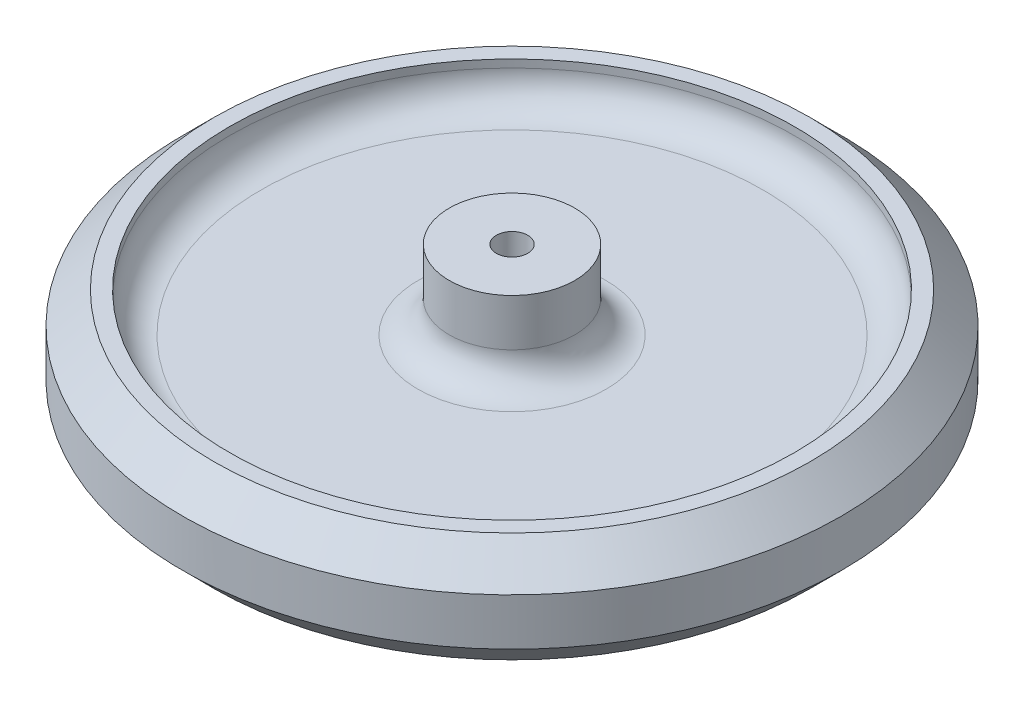
ISO-10303-21;
HEADER;
FILE_DESCRIPTION(('STEP AP214'),'2;1');
FILE_NAME('part.step','',(''),(''),'','','');
FILE_SCHEMA(('AUTOMOTIVE_DESIGN { 1 0 10303 214 1 1 1 1 }'));
ENDSEC;
DATA;
#1=APPLICATION_CONTEXT('core data for automotive mechanical design processes');
#2=APPLICATION_PROTOCOL_DEFINITION('international standard','automotive_design',2000,#1);
#3=PRODUCT_CONTEXT('',#1,'mechanical');
#4=PRODUCT('Part','Part','',(#3));
#5=PRODUCT_RELATED_PRODUCT_CATEGORY('part','',(#4));
#6=PRODUCT_DEFINITION_FORMATION('','',#4);
#7=PRODUCT_DEFINITION_CONTEXT('part definition',#1,'design');
#8=PRODUCT_DEFINITION('design','',#6,#7);
#9=PRODUCT_DEFINITION_SHAPE('','',#8);
#10=(LENGTH_UNIT() NAMED_UNIT(*) SI_UNIT(.MILLI.,.METRE.));
#11=(NAMED_UNIT(*) PLANE_ANGLE_UNIT() SI_UNIT($,.RADIAN.));
#12=(NAMED_UNIT(*) SI_UNIT($,.STERADIAN.) SOLID_ANGLE_UNIT());
#13=UNCERTAINTY_MEASURE_WITH_UNIT(LENGTH_MEASURE(1.E-05),#10,'distance_accuracy_value','');
#14=(GEOMETRIC_REPRESENTATION_CONTEXT(3) GLOBAL_UNCERTAINTY_ASSIGNED_CONTEXT((#13)) GLOBAL_UNIT_ASSIGNED_CONTEXT((#10,
#11,#12)) REPRESENTATION_CONTEXT('',''));
#15=CARTESIAN_POINT('',(0.,0.,0.));
#16=DIRECTION('',(0.,0.,1.));
#17=DIRECTION('',(1.,0.,0.));
#18=AXIS2_PLACEMENT_3D('',#15,#16,#17);
#19=CARTESIAN_POINT('',(-6.35,1.5875,0.));
#20=DIRECTION('',(0.,-1.,0.));
#21=DIRECTION('',(1.,0.,0.));
#22=AXIS2_PLACEMENT_3D('',#19,#20,#21);
#23=PLANE('',#22);
#24=CARTESIAN_POINT('',(0.,1.5875,0.));
#25=DIRECTION('',(0.,-1.,0.));
#26=DIRECTION('',(1.,0.,0.));
#27=AXIS2_PLACEMENT_3D('',#24,#25,#26);
#28=CIRCLE('',#27,9.525);
#29=CARTESIAN_POINT('',(9.525,1.5875,0.));
#30=VERTEX_POINT('',#29);
#31=EDGE_CURVE('E57',#30,#30,#28,.T.);
#32=ORIENTED_EDGE('',*,*,#31,.T.);
#33=EDGE_LOOP('',(#32));
#34=FACE_BOUND('',#33,.T.);
#35=CARTESIAN_POINT('',(0.,1.5875,0.));
#36=DIRECTION('',(0.,-1.,0.));
#37=DIRECTION('',(1.,0.,0.));
#38=AXIS2_PLACEMENT_3D('',#35,#36,#37);
#39=CIRCLE('',#38,25.4);
#40=CARTESIAN_POINT('',(25.4,1.58750000000001,0.));
#41=VERTEX_POINT('',#40);
#42=EDGE_CURVE('E60',#41,#41,#39,.F.);
#43=ORIENTED_EDGE('',*,*,#42,.T.);
#44=EDGE_LOOP('',(#43));
#45=FACE_BOUND('',#44,.T.);
#46=ADVANCED_FACE('F31',(#34,#45),#23,.F.);
#47=CARTESIAN_POINT('',(0.,-9.525,0.));
#48=DIRECTION('',(0.,-1.,0.));
#49=DIRECTION('',(1.,0.,0.));
#50=AXIS2_PLACEMENT_3D('',#47,#48,#49);
#51=CYLINDRICAL_SURFACE('',#50,6.35);
#52=CARTESIAN_POINT('',(0.,4.7625,0.));
#53=DIRECTION('',(0.,-1.,0.));
#54=DIRECTION('',(1.,0.,0.));
#55=AXIS2_PLACEMENT_3D('',#52,#53,#54);
#56=CIRCLE('',#55,6.35);
#57=CARTESIAN_POINT('',(6.35,4.7625,0.));
#58=VERTEX_POINT('',#57);
#59=EDGE_CURVE('E54',#58,#58,#56,.F.);
#60=ORIENTED_EDGE('',*,*,#59,.T.);
#61=EDGE_LOOP('',(#60));
#62=FACE_BOUND('',#61,.T.);
#63=CARTESIAN_POINT('',(0.,9.525,0.));
#64=DIRECTION('',(0.,-1.,0.));
#65=DIRECTION('',(1.,0.,0.));
#66=AXIS2_PLACEMENT_3D('',#63,#64,#65);
#67=CIRCLE('',#66,6.35);
#68=CARTESIAN_POINT('',(6.35,9.525,0.));
#69=VERTEX_POINT('',#68);
#70=EDGE_CURVE('E75',#69,#69,#67,.T.);
#71=ORIENTED_EDGE('',*,*,#70,.T.);
#72=EDGE_LOOP('',(#71));
#73=FACE_BOUND('',#72,.T.);
#74=ADVANCED_FACE('F111',(#62,#73),#51,.T.);
#75=CARTESIAN_POINT('',(-6.35,9.525,0.));
#76=DIRECTION('',(0.,-1.,0.));
#77=DIRECTION('',(1.,0.,0.));
#78=AXIS2_PLACEMENT_3D('',#75,#76,#77);
#79=PLANE('',#78);
#80=ORIENTED_EDGE('',*,*,#70,.F.);
#81=EDGE_LOOP('',(#80));
#82=FACE_BOUND('',#81,.T.);
#83=CARTESIAN_POINT('',(0.,9.525,0.));
#84=DIRECTION('',(0.,-1.,0.));
#85=DIRECTION('',(1.,0.,0.));
#86=AXIS2_PLACEMENT_3D('',#83,#84,#85);
#87=CIRCLE('',#86,1.5875);
#88=CARTESIAN_POINT('',(1.5875,9.525,0.));
#89=VERTEX_POINT('',#88);
#90=EDGE_CURVE('E78',#89,#89,#87,.T.);
#91=ORIENTED_EDGE('',*,*,#90,.T.);
#92=EDGE_LOOP('',(#91));
#93=FACE_BOUND('',#92,.T.);
#94=ADVANCED_FACE('F117',(#82,#93),#79,.F.);
#95=CARTESIAN_POINT('',(0.,-9.525,0.));
#96=DIRECTION('',(0.,-1.,0.));
#97=DIRECTION('',(1.,0.,0.));
#98=AXIS2_PLACEMENT_3D('',#95,#96,#97);
#99=CYLINDRICAL_SURFACE('',#98,1.5875);
#100=ORIENTED_EDGE('',*,*,#90,.F.);
#101=EDGE_LOOP('',(#100));
#102=FACE_BOUND('',#101,.T.);
#103=CARTESIAN_POINT('',(0.,-9.525,0.));
#104=DIRECTION('',(0.,-1.,0.));
#105=DIRECTION('',(1.,0.,0.));
#106=AXIS2_PLACEMENT_3D('',#103,#104,#105);
#107=CIRCLE('',#106,1.5875);
#108=CARTESIAN_POINT('',(1.5875,-9.525,0.));
#109=VERTEX_POINT('',#108);
#110=EDGE_CURVE('E81',#109,#109,#107,.T.);
#111=ORIENTED_EDGE('',*,*,#110,.T.);
#112=EDGE_LOOP('',(#111));
#113=FACE_BOUND('',#112,.T.);
#114=ADVANCED_FACE('F169',(#102,#113),#99,.F.);
#115=CARTESIAN_POINT('',(-1.5875,-9.525,0.));
#116=DIRECTION('',(0.,1.,0.));
#117=DIRECTION('',(-1.,0.,0.));
#118=AXIS2_PLACEMENT_3D('',#115,#116,#117);
#119=PLANE('',#118);
#120=ORIENTED_EDGE('',*,*,#110,.F.);
#121=EDGE_LOOP('',(#120));
#122=FACE_BOUND('',#121,.T.);
#123=CARTESIAN_POINT('',(0.,-9.525,0.));
#124=DIRECTION('',(0.,-1.,0.));
#125=DIRECTION('',(1.,0.,0.));
#126=AXIS2_PLACEMENT_3D('',#123,#124,#125);
#127=CIRCLE('',#126,6.35);
#128=CARTESIAN_POINT('',(6.35,-9.525,0.));
#129=VERTEX_POINT('',#128);
#130=EDGE_CURVE('E84',#129,#129,#127,.T.);
#131=ORIENTED_EDGE('',*,*,#130,.T.);
#132=EDGE_LOOP('',(#131));
#133=FACE_BOUND('',#132,.T.);
#134=ADVANCED_FACE('F165',(#122,#133),#119,.F.);
#135=CARTESIAN_POINT('',(0.,-9.525,0.));
#136=DIRECTION('',(0.,-1.,0.));
#137=DIRECTION('',(1.,0.,0.));
#138=AXIS2_PLACEMENT_3D('',#135,#136,#137);
#139=CYLINDRICAL_SURFACE('',#138,6.35);
#140=CARTESIAN_POINT('',(0.,-4.7625,0.));
#141=DIRECTION('',(0.,1.,0.));
#142=DIRECTION('',(-1.,0.,0.));
#143=AXIS2_PLACEMENT_3D('',#140,#141,#142);
#144=CIRCLE('',#143,6.35);
#145=CARTESIAN_POINT('',(-6.35,-4.7625,0.));
#146=VERTEX_POINT('',#145);
#147=EDGE_CURVE('E63',#146,#146,#144,.F.);
#148=ORIENTED_EDGE('',*,*,#147,.T.);
#149=EDGE_LOOP('',(#148));
#150=FACE_BOUND('',#149,.T.);
#151=ORIENTED_EDGE('',*,*,#130,.F.);
#152=EDGE_LOOP('',(#151));
#153=FACE_BOUND('',#152,.T.);
#154=ADVANCED_FACE('F161',(#150,#153),#139,.T.);
#155=CARTESIAN_POINT('',(-28.575,-1.58750000000001,0.));
#156=DIRECTION('',(0.,1.,0.));
#157=DIRECTION('',(-1.,0.,0.));
#158=AXIS2_PLACEMENT_3D('',#155,#156,#157);
#159=PLANE('',#158);
#160=CARTESIAN_POINT('',(0.,-1.5875,0.));
#161=DIRECTION('',(0.,1.,0.));
#162=DIRECTION('',(-1.,0.,0.));
#163=AXIS2_PLACEMENT_3D('',#160,#161,#162);
#164=CIRCLE('',#163,25.4);
#165=CARTESIAN_POINT('',(-25.4,-1.58750000000001,0.));
#166=VERTEX_POINT('',#165);
#167=EDGE_CURVE('E69',#166,#166,#164,.F.);
#168=ORIENTED_EDGE('',*,*,#167,.T.);
#169=EDGE_LOOP('',(#168));
#170=FACE_BOUND('',#169,.T.);
#171=CARTESIAN_POINT('',(0.,-1.5875,0.));
#172=DIRECTION('',(0.,1.,0.));
#173=DIRECTION('',(-1.,0.,0.));
#174=AXIS2_PLACEMENT_3D('',#171,#172,#173);
#175=CIRCLE('',#174,9.525);
#176=CARTESIAN_POINT('',(-9.525,-1.5875,0.));
#177=VERTEX_POINT('',#176);
#178=EDGE_CURVE('E72',#177,#177,#175,.T.);
#179=ORIENTED_EDGE('',*,*,#178,.T.);
#180=EDGE_LOOP('',(#179));
#181=FACE_BOUND('',#180,.T.);
#182=ADVANCED_FACE('F157',(#170,#181),#159,.F.);
#183=CARTESIAN_POINT('',(0.,-9.525,0.));
#184=DIRECTION('',(0.,-1.,0.));
#185=DIRECTION('',(1.,0.,0.));
#186=AXIS2_PLACEMENT_3D('',#183,#184,#185);
#187=CYLINDRICAL_SURFACE('',#186,28.575);
#188=CARTESIAN_POINT('',(0.,-4.7625,0.));
#189=DIRECTION('',(0.,1.,0.));
#190=DIRECTION('',(-1.,0.,0.));
#191=AXIS2_PLACEMENT_3D('',#188,#189,#190);
#192=CIRCLE('',#191,28.575);
#193=CARTESIAN_POINT('',(-28.575,-4.76250000000001,0.));
#194=VERTEX_POINT('',#193);
#195=EDGE_CURVE('E66',#194,#194,#192,.T.);
#196=ORIENTED_EDGE('',*,*,#195,.T.);
#197=EDGE_LOOP('',(#196));
#198=FACE_BOUND('',#197,.T.);
#199=CARTESIAN_POINT('',(0.,-5.55625,0.));
#200=DIRECTION('',(0.,-1.,0.));
#201=DIRECTION('',(1.,0.,0.));
#202=AXIS2_PLACEMENT_3D('',#199,#200,#201);
#203=CIRCLE('',#202,28.575);
#204=CARTESIAN_POINT('',(28.575,-5.55624999999999,0.));
#205=VERTEX_POINT('',#204);
#206=EDGE_CURVE('E87',#205,#205,#203,.T.);
#207=ORIENTED_EDGE('',*,*,#206,.T.);
#208=EDGE_LOOP('',(#207));
#209=FACE_BOUND('',#208,.T.);
#210=ADVANCED_FACE('F152',(#198,#209),#187,.F.);
#211=CARTESIAN_POINT('',(-33.3375,-5.55625000000001,0.));
#212=DIRECTION('',(0.,1.,0.));
#213=DIRECTION('',(-1.,0.,0.));
#214=AXIS2_PLACEMENT_3D('',#211,#212,#213);
#215=PLANE('',#214);
#216=CARTESIAN_POINT('',(0.,-5.55625,0.));
#217=DIRECTION('',(0.,1.,0.));
#218=DIRECTION('',(-1.,0.,0.));
#219=AXIS2_PLACEMENT_3D('',#216,#217,#218);
#220=CIRCLE('',#219,30.1625);
#221=CARTESIAN_POINT('',(-30.1625,-5.55625000000001,0.));
#222=VERTEX_POINT('',#221);
#223=EDGE_CURVE('E10',#222,#222,#220,.F.);
#224=ORIENTED_EDGE('',*,*,#223,.T.);
#225=EDGE_LOOP('',(#224));
#226=FACE_BOUND('',#225,.T.);
#227=ORIENTED_EDGE('',*,*,#206,.F.);
#228=EDGE_LOOP('',(#227));
#229=FACE_BOUND('',#228,.T.);
#230=ADVANCED_FACE('F145',(#226,#229),#215,.F.);
#231=CARTESIAN_POINT('',(0.,-9.525,0.));
#232=DIRECTION('',(0.,-1.,0.));
#233=DIRECTION('',(1.,0.,0.));
#234=AXIS2_PLACEMENT_3D('',#231,#232,#233);
#235=CYLINDRICAL_SURFACE('',#234,33.3375);
#236=CARTESIAN_POINT('',(0.,2.38124999999997,0.));
#237=DIRECTION('',(0.,-1.,0.));
#238=DIRECTION('',(1.,0.,0.));
#239=AXIS2_PLACEMENT_3D('',#236,#237,#238);
#240=CIRCLE('',#239,33.3375);
#241=CARTESIAN_POINT('',(33.3375,2.38124999999997,0.));
#242=VERTEX_POINT('',#241);
#243=EDGE_CURVE('E42',#242,#242,#240,.T.);
#244=ORIENTED_EDGE('',*,*,#243,.T.);
#245=EDGE_LOOP('',(#244));
#246=FACE_BOUND('',#245,.T.);
#247=CARTESIAN_POINT('',(0.,-2.38124999999996,0.));
#248=DIRECTION('',(0.,1.,0.));
#249=DIRECTION('',(-1.,0.,0.));
#250=AXIS2_PLACEMENT_3D('',#247,#248,#249);
#251=CIRCLE('',#250,33.3375);
#252=CARTESIAN_POINT('',(-33.3375,-2.38124999999997,0.));
#253=VERTEX_POINT('',#252);
#254=EDGE_CURVE('E46',#253,#253,#251,.T.);
#255=ORIENTED_EDGE('',*,*,#254,.T.);
#256=EDGE_LOOP('',(#255));
#257=FACE_BOUND('',#256,.T.);
#258=ADVANCED_FACE('F108',(#246,#257),#235,.T.);
#259=CARTESIAN_POINT('',(-28.575,5.55624999999999,0.));
#260=DIRECTION('',(0.,-1.,0.));
#261=DIRECTION('',(1.,0.,0.));
#262=AXIS2_PLACEMENT_3D('',#259,#260,#261);
#263=PLANE('',#262);
#264=CARTESIAN_POINT('',(0.,5.55625,0.));
#265=DIRECTION('',(0.,-1.,0.));
#266=DIRECTION('',(1.,0.,0.));
#267=AXIS2_PLACEMENT_3D('',#264,#265,#266);
#268=CIRCLE('',#267,30.1625);
#269=CARTESIAN_POINT('',(30.1624999999999,5.55625,0.));
#270=VERTEX_POINT('',#269);
#271=EDGE_CURVE('E38',#270,#270,#268,.F.);
#272=ORIENTED_EDGE('',*,*,#271,.T.);
#273=EDGE_LOOP('',(#272));
#274=FACE_BOUND('',#273,.T.);
#275=CARTESIAN_POINT('',(0.,5.55625,0.));
#276=DIRECTION('',(0.,-1.,0.));
#277=DIRECTION('',(1.,0.,0.));
#278=AXIS2_PLACEMENT_3D('',#275,#276,#277);
#279=CIRCLE('',#278,28.575);
#280=CARTESIAN_POINT('',(28.575,5.55625,0.));
#281=VERTEX_POINT('',#280);
#282=EDGE_CURVE('E90',#281,#281,#279,.T.);
#283=ORIENTED_EDGE('',*,*,#282,.T.);
#284=EDGE_LOOP('',(#283));
#285=FACE_BOUND('',#284,.T.);
#286=ADVANCED_FACE('F94',(#274,#285),#263,.F.);
#287=CARTESIAN_POINT('',(0.,-9.525,0.));
#288=DIRECTION('',(0.,-1.,0.));
#289=DIRECTION('',(1.,0.,0.));
#290=AXIS2_PLACEMENT_3D('',#287,#288,#289);
#291=CYLINDRICAL_SURFACE('',#290,28.575);
#292=CARTESIAN_POINT('',(0.,4.7625,0.));
#293=DIRECTION('',(0.,-1.,0.));
#294=DIRECTION('',(1.,0.,0.));
#295=AXIS2_PLACEMENT_3D('',#292,#293,#294);
#296=CIRCLE('',#295,28.575);
#297=CARTESIAN_POINT('',(28.575,4.76250000000001,0.));
#298=VERTEX_POINT('',#297);
#299=EDGE_CURVE('E51',#298,#298,#296,.T.);
#300=ORIENTED_EDGE('',*,*,#299,.T.);
#301=EDGE_LOOP('',(#300));
#302=FACE_BOUND('',#301,.T.);
#303=ORIENTED_EDGE('',*,*,#282,.F.);
#304=EDGE_LOOP('',(#303));
#305=FACE_BOUND('',#304,.T.);
#306=ADVANCED_FACE('F96',(#302,#305),#291,.F.);
#307=CARTESIAN_POINT('',(0.,-4.7625,0.));
#308=DIRECTION('',(0.,1.,0.));
#309=DIRECTION('',(-1.,0.,0.));
#310=AXIS2_PLACEMENT_3D('',#307,#308,#309);
#311=TOROIDAL_SURFACE('',#310,25.4,3.175);
#312=ORIENTED_EDGE('',*,*,#195,.F.);
#313=EDGE_LOOP('',(#312));
#314=FACE_BOUND('',#313,.T.);
#315=ORIENTED_EDGE('',*,*,#167,.F.);
#316=EDGE_LOOP('',(#315));
#317=FACE_BOUND('',#316,.T.);
#318=ADVANCED_FACE('F98',(#314,#317),#311,.F.);
#319=CARTESIAN_POINT('',(0.,-4.7625,0.));
#320=DIRECTION('',(0.,1.,0.));
#321=DIRECTION('',(-1.,0.,0.));
#322=AXIS2_PLACEMENT_3D('',#319,#320,#321);
#323=TOROIDAL_SURFACE('',#322,9.525,3.175);
#324=ORIENTED_EDGE('',*,*,#178,.F.);
#325=EDGE_LOOP('',(#324));
#326=FACE_BOUND('',#325,.T.);
#327=ORIENTED_EDGE('',*,*,#147,.F.);
#328=EDGE_LOOP('',(#327));
#329=FACE_BOUND('',#328,.T.);
#330=ADVANCED_FACE('F105',(#326,#329),#323,.F.);
#331=CARTESIAN_POINT('',(0.,4.7625,0.));
#332=DIRECTION('',(0.,-1.,0.));
#333=DIRECTION('',(1.,0.,0.));
#334=AXIS2_PLACEMENT_3D('',#331,#332,#333);
#335=TOROIDAL_SURFACE('',#334,9.525,3.175);
#336=ORIENTED_EDGE('',*,*,#59,.F.);
#337=EDGE_LOOP('',(#336));
#338=FACE_BOUND('',#337,.T.);
#339=ORIENTED_EDGE('',*,*,#31,.F.);
#340=EDGE_LOOP('',(#339));
#341=FACE_BOUND('',#340,.T.);
#342=ADVANCED_FACE('F125',(#338,#341),#335,.F.);
#343=CARTESIAN_POINT('',(0.,4.7625,0.));
#344=DIRECTION('',(0.,-1.,0.));
#345=DIRECTION('',(1.,0.,0.));
#346=AXIS2_PLACEMENT_3D('',#343,#344,#345);
#347=TOROIDAL_SURFACE('',#346,25.4,3.175);
#348=ORIENTED_EDGE('',*,*,#42,.F.);
#349=EDGE_LOOP('',(#348));
#350=FACE_BOUND('',#349,.T.);
#351=ORIENTED_EDGE('',*,*,#299,.F.);
#352=EDGE_LOOP('',(#351));
#353=FACE_BOUND('',#352,.T.);
#354=ADVANCED_FACE('F129',(#350,#353),#347,.F.);
#355=CARTESIAN_POINT('',(0.,2.38124999999997,0.));
#356=DIRECTION('',(0.,-1.,0.));
#357=DIRECTION('',(1.,0.,0.));
#358=AXIS2_PLACEMENT_3D('',#355,#356,#357);
#359=CONICAL_SURFACE('',#358,33.3375,0.785398163397451);
#360=ORIENTED_EDGE('',*,*,#271,.F.);
#361=EDGE_LOOP('',(#360));
#362=FACE_BOUND('',#361,.T.);
#363=ORIENTED_EDGE('',*,*,#243,.F.);
#364=EDGE_LOOP('',(#363));
#365=FACE_BOUND('',#364,.T.);
#366=ADVANCED_FACE('F132',(#362,#365),#359,.T.);
#367=CARTESIAN_POINT('',(0.,-5.55625,0.));
#368=DIRECTION('',(0.,1.,0.));
#369=DIRECTION('',(-1.,0.,0.));
#370=AXIS2_PLACEMENT_3D('',#367,#368,#369);
#371=CONICAL_SURFACE('',#370,30.1625,0.785398163397446);
#372=ORIENTED_EDGE('',*,*,#254,.F.);
#373=EDGE_LOOP('',(#372));
#374=FACE_BOUND('',#373,.T.);
#375=ORIENTED_EDGE('',*,*,#223,.F.);
#376=EDGE_LOOP('',(#375));
#377=FACE_BOUND('',#376,.T.);
#378=ADVANCED_FACE('F33',(#374,#377),#371,.T.);
#379=CLOSED_SHELL('',(#46,#74,#94,#114,#134,#154,#182,#210,#230,#258,#286,#306,#318,#330,#342,
#354,#366,#378));
#380=MANIFOLD_SOLID_BREP('B2',#379);
#381=ADVANCED_BREP_SHAPE_REPRESENTATION('',(#18,#380),#14);
#382=SHAPE_DEFINITION_REPRESENTATION(#9,#381);
ENDSEC;
END-ISO-10303-21;
